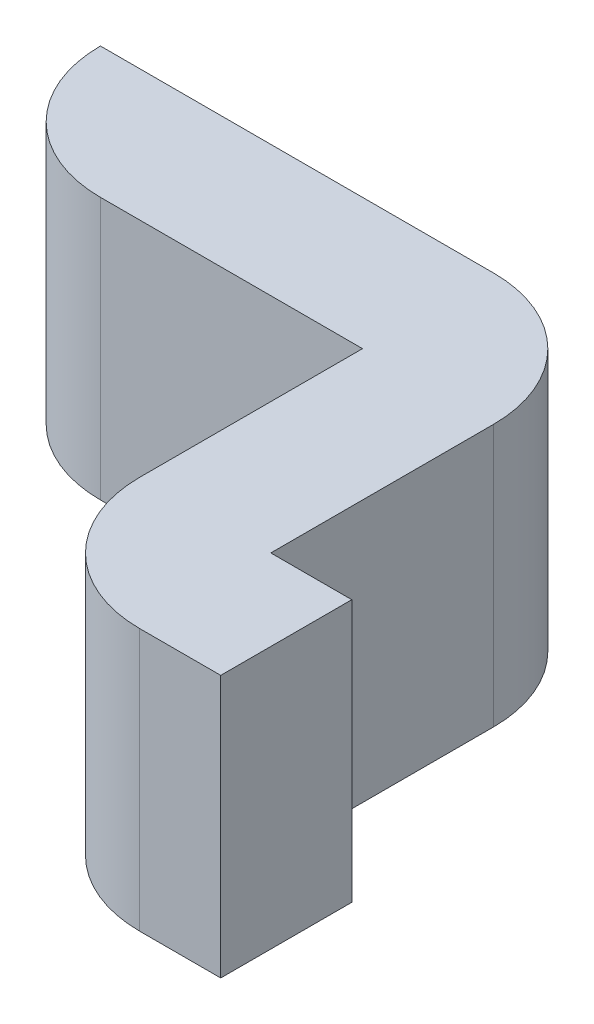
ISO-10303-21;
HEADER;
FILE_DESCRIPTION(('STEP AP214'),'2;1');
FILE_NAME('part.step','',(''),(''),'','','');
FILE_SCHEMA(('AUTOMOTIVE_DESIGN { 1 0 10303 214 1 1 1 1 }'));
ENDSEC;
DATA;
#1=APPLICATION_CONTEXT('core data for automotive mechanical design processes');
#2=APPLICATION_PROTOCOL_DEFINITION('international standard','automotive_design',2000,#1);
#3=PRODUCT_CONTEXT('',#1,'mechanical');
#4=PRODUCT('Part','Part','',(#3));
#5=PRODUCT_RELATED_PRODUCT_CATEGORY('part','',(#4));
#6=PRODUCT_DEFINITION_FORMATION('','',#4);
#7=PRODUCT_DEFINITION_CONTEXT('part definition',#1,'design');
#8=PRODUCT_DEFINITION('design','',#6,#7);
#9=PRODUCT_DEFINITION_SHAPE('','',#8);
#10=(LENGTH_UNIT() NAMED_UNIT(*) SI_UNIT(.MILLI.,.METRE.));
#11=(NAMED_UNIT(*) PLANE_ANGLE_UNIT() SI_UNIT($,.RADIAN.));
#12=(NAMED_UNIT(*) SI_UNIT($,.STERADIAN.) SOLID_ANGLE_UNIT());
#13=UNCERTAINTY_MEASURE_WITH_UNIT(LENGTH_MEASURE(1.E-05),#10,'distance_accuracy_value','');
#14=(GEOMETRIC_REPRESENTATION_CONTEXT(3) GLOBAL_UNCERTAINTY_ASSIGNED_CONTEXT((#13)) GLOBAL_UNIT_ASSIGNED_CONTEXT((#10,
#11,#12)) REPRESENTATION_CONTEXT('',''));
#15=CARTESIAN_POINT('',(0.,0.,0.));
#16=DIRECTION('',(0.,0.,1.));
#17=DIRECTION('',(1.,0.,0.));
#18=AXIS2_PLACEMENT_3D('',#15,#16,#17);
#19=CARTESIAN_POINT('',(0.8763,1.2954,0.));
#20=DIRECTION('',(0.,-1.,0.));
#21=DIRECTION('',(0.,0.,-1.));
#22=AXIS2_PLACEMENT_3D('',#19,#20,#21);
#23=PLANE('',#22);
#24=DIRECTION('',(-1.,0.,0.));
#25=VECTOR('',#24,1.);
#26=CARTESIAN_POINT('',(1.0033,1.2954,0.127));
#27=LINE('',#26,#25);
#28=CARTESIAN_POINT('',(1.0033,1.2954,0.127));
#29=VERTEX_POINT('',#28);
#30=CARTESIAN_POINT('',(1.2573,1.2954,0.127));
#31=VERTEX_POINT('',#30);
#32=EDGE_CURVE('E102',#29,#31,#27,.F.);
#33=ORIENTED_EDGE('',*,*,#32,.T.);
#34=DIRECTION('',(0.,0.,-1.));
#35=VECTOR('',#34,1.);
#36=CARTESIAN_POINT('',(1.2573,1.2954,0.127));
#37=LINE('',#36,#35);
#38=CARTESIAN_POINT('',(1.2573,1.2954,0.3429));
#39=VERTEX_POINT('',#38);
#40=EDGE_CURVE('E105',#31,#39,#37,.F.);
#41=ORIENTED_EDGE('',*,*,#40,.T.);
#42=CARTESIAN_POINT('',(1.3843,1.2954,0.3429));
#43=DIRECTION('',(0.,-1.,0.));
#44=DIRECTION('',(0.,0.,-1.));
#45=AXIS2_PLACEMENT_3D('',#42,#43,#44);
#46=CIRCLE('',#45,0.127);
#47=CARTESIAN_POINT('',(1.3843,1.2954,0.4699));
#48=VERTEX_POINT('',#47);
#49=EDGE_CURVE('E117',#48,#39,#46,.T.);
#50=ORIENTED_EDGE('',*,*,#49,.F.);
#51=DIRECTION('',(-1.,0.,0.));
#52=VECTOR('',#51,1.);
#53=CARTESIAN_POINT('',(1.3843,1.2954,0.4699));
#54=LINE('',#53,#52);
#55=CARTESIAN_POINT('',(1.462781115147,1.2954,0.4699));
#56=VERTEX_POINT('',#55);
#57=EDGE_CURVE('E134',#48,#56,#54,.F.);
#58=ORIENTED_EDGE('',*,*,#57,.T.);
#59=DIRECTION('',(0.,0.,1.));
#60=VECTOR('',#59,1.);
#61=CARTESIAN_POINT('',(1.462781115147,1.2954,0.4699));
#62=LINE('',#61,#60);
#63=CARTESIAN_POINT('',(1.462781115147,1.2954,0.3429));
#64=VERTEX_POINT('',#63);
#65=EDGE_CURVE('E90',#56,#64,#62,.F.);
#66=ORIENTED_EDGE('',*,*,#65,.T.);
#67=DIRECTION('',(1.,0.,0.));
#68=VECTOR('',#67,1.);
#69=CARTESIAN_POINT('',(1.462781115147,1.2954,0.3429));
#70=LINE('',#69,#68);
#71=CARTESIAN_POINT('',(1.3843,1.2954,0.3429));
#72=VERTEX_POINT('',#71);
#73=EDGE_CURVE('E87',#64,#72,#70,.F.);
#74=ORIENTED_EDGE('',*,*,#73,.T.);
#75=DIRECTION('',(0.,0.,1.));
#76=VECTOR('',#75,1.);
#77=CARTESIAN_POINT('',(1.3843,1.2954,0.3429));
#78=LINE('',#77,#76);
#79=CARTESIAN_POINT('',(1.3843,1.2954,0.127));
#80=VERTEX_POINT('',#79);
#81=EDGE_CURVE('E82',#72,#80,#78,.F.);
#82=ORIENTED_EDGE('',*,*,#81,.T.);
#83=CARTESIAN_POINT('',(1.2573,1.2954,0.127));
#84=DIRECTION('',(0.,-1.,0.));
#85=DIRECTION('',(0.,0.,-1.));
#86=AXIS2_PLACEMENT_3D('',#83,#84,#85);
#87=CIRCLE('',#86,0.127);
#88=CARTESIAN_POINT('',(1.2573,1.2954,0.));
#89=VERTEX_POINT('',#88);
#90=EDGE_CURVE('E20',#89,#80,#87,.T.);
#91=ORIENTED_EDGE('',*,*,#90,.F.);
#92=DIRECTION('',(1.,0.,0.));
#93=VECTOR('',#92,1.);
#94=CARTESIAN_POINT('',(1.2573,1.2954,0.));
#95=LINE('',#94,#93);
#96=CARTESIAN_POINT('',(0.8763,1.2954,0.));
#97=VERTEX_POINT('',#96);
#98=EDGE_CURVE('E76',#89,#97,#95,.F.);
#99=ORIENTED_EDGE('',*,*,#98,.T.);
#100=CARTESIAN_POINT('',(1.0033,1.2954,0.));
#101=DIRECTION('',(0.,-1.,0.));
#102=DIRECTION('',(0.,0.,-1.));
#103=AXIS2_PLACEMENT_3D('',#100,#101,#102);
#104=CIRCLE('',#103,0.127);
#105=EDGE_CURVE('E108',#29,#97,#104,.T.);
#106=ORIENTED_EDGE('',*,*,#105,.F.);
#107=EDGE_LOOP('',(#33,#41,#50,#58,#66,#74,#82,#91,#99,#106));
#108=FACE_BOUND('',#107,.T.);
#109=ADVANCED_FACE('F17',(#108),#23,.F.);
#110=CARTESIAN_POINT('',(1.2573,1.0414,0.));
#111=DIRECTION('',(0.,0.,1.));
#112=DIRECTION('',(1.,0.,0.));
#113=AXIS2_PLACEMENT_3D('',#110,#111,#112);
#114=PLANE('',#113);
#115=DIRECTION('',(0.,-1.,0.));
#116=VECTOR('',#115,1.);
#117=CARTESIAN_POINT('',(0.8763,1.0414,0.));
#118=LINE('',#117,#116);
#119=CARTESIAN_POINT('',(0.8763,1.0414,0.));
#120=VERTEX_POINT('',#119);
#121=EDGE_CURVE('E187',#97,#120,#118,.T.);
#122=ORIENTED_EDGE('',*,*,#121,.F.);
#123=ORIENTED_EDGE('',*,*,#98,.F.);
#124=DIRECTION('',(0.,-1.,0.));
#125=VECTOR('',#124,1.);
#126=CARTESIAN_POINT('',(1.2573,1.0414,0.));
#127=LINE('',#126,#125);
#128=CARTESIAN_POINT('',(1.2573,1.0414,0.));
#129=VERTEX_POINT('',#128);
#130=EDGE_CURVE('E159',#129,#89,#127,.F.);
#131=ORIENTED_EDGE('',*,*,#130,.F.);
#132=DIRECTION('',(1.,0.,0.));
#133=VECTOR('',#132,1.);
#134=CARTESIAN_POINT('',(0.8763,1.0414,0.));
#135=LINE('',#134,#133);
#136=EDGE_CURVE('E186',#120,#129,#135,.T.);
#137=ORIENTED_EDGE('',*,*,#136,.F.);
#138=EDGE_LOOP('',(#122,#123,#131,#137));
#139=FACE_BOUND('',#138,.T.);
#140=ADVANCED_FACE('F217',(#139),#114,.F.);
#141=CARTESIAN_POINT('',(1.2573,1.0414,0.127));
#142=DIRECTION('',(0.,-1.,0.));
#143=DIRECTION('',(0.,0.,-1.));
#144=AXIS2_PLACEMENT_3D('',#141,#142,#143);
#145=CYLINDRICAL_SURFACE('',#144,0.127);
#146=ORIENTED_EDGE('',*,*,#90,.T.);
#147=DIRECTION('',(0.,1.,0.));
#148=VECTOR('',#147,1.);
#149=CARTESIAN_POINT('',(1.3843,1.0414,0.127));
#150=LINE('',#149,#148);
#151=CARTESIAN_POINT('',(1.3843,1.0414,0.127));
#152=VERTEX_POINT('',#151);
#153=EDGE_CURVE('E157',#80,#152,#150,.F.);
#154=ORIENTED_EDGE('',*,*,#153,.T.);
#155=CARTESIAN_POINT('',(1.2573,1.0414,0.127));
#156=DIRECTION('',(0.,-1.,0.));
#157=DIRECTION('',(0.,0.,-1.));
#158=AXIS2_PLACEMENT_3D('',#155,#156,#157);
#159=CIRCLE('',#158,0.127);
#160=EDGE_CURVE('E183',#129,#152,#159,.T.);
#161=ORIENTED_EDGE('',*,*,#160,.F.);
#162=ORIENTED_EDGE('',*,*,#130,.T.);
#163=EDGE_LOOP('',(#146,#154,#161,#162));
#164=FACE_BOUND('',#163,.T.);
#165=ADVANCED_FACE('F214',(#164),#145,.T.);
#166=CARTESIAN_POINT('',(1.3843,1.0414,0.3429));
#167=DIRECTION('',(-1.,0.,0.));
#168=DIRECTION('',(0.,0.,1.));
#169=AXIS2_PLACEMENT_3D('',#166,#167,#168);
#170=PLANE('',#169);
#171=ORIENTED_EDGE('',*,*,#153,.F.);
#172=ORIENTED_EDGE('',*,*,#81,.F.);
#173=DIRECTION('',(0.,1.,0.));
#174=VECTOR('',#173,1.);
#175=CARTESIAN_POINT('',(1.3843,1.0414,0.3429));
#176=LINE('',#175,#174);
#177=CARTESIAN_POINT('',(1.3843,1.0414,0.3429));
#178=VERTEX_POINT('',#177);
#179=EDGE_CURVE('E153',#72,#178,#176,.F.);
#180=ORIENTED_EDGE('',*,*,#179,.T.);
#181=DIRECTION('',(0.,0.,-1.));
#182=VECTOR('',#181,1.);
#183=CARTESIAN_POINT('',(1.3843,1.0414,0.));
#184=LINE('',#183,#182);
#185=EDGE_CURVE('E150',#152,#178,#184,.F.);
#186=ORIENTED_EDGE('',*,*,#185,.F.);
#187=EDGE_LOOP('',(#171,#172,#180,#186));
#188=FACE_BOUND('',#187,.T.);
#189=ADVANCED_FACE('F211',(#188),#170,.F.);
#190=CARTESIAN_POINT('',(1.462781115147,1.0414,0.3429));
#191=DIRECTION('',(0.,0.,1.));
#192=DIRECTION('',(1.,0.,0.));
#193=AXIS2_PLACEMENT_3D('',#190,#191,#192);
#194=PLANE('',#193);
#195=ORIENTED_EDGE('',*,*,#179,.F.);
#196=ORIENTED_EDGE('',*,*,#73,.F.);
#197=DIRECTION('',(0.,1.,0.));
#198=VECTOR('',#197,1.);
#199=CARTESIAN_POINT('',(1.462781115147,1.0414,0.3429));
#200=LINE('',#199,#198);
#201=CARTESIAN_POINT('',(1.462781115147,1.0414,0.3429));
#202=VERTEX_POINT('',#201);
#203=EDGE_CURVE('E144',#64,#202,#200,.F.);
#204=ORIENTED_EDGE('',*,*,#203,.T.);
#205=DIRECTION('',(1.,0.,0.));
#206=VECTOR('',#205,1.);
#207=CARTESIAN_POINT('',(0.8763,1.0414,0.3429));
#208=LINE('',#207,#206);
#209=EDGE_CURVE('E141',#178,#202,#208,.T.);
#210=ORIENTED_EDGE('',*,*,#209,.F.);
#211=EDGE_LOOP('',(#195,#196,#204,#210));
#212=FACE_BOUND('',#211,.T.);
#213=ADVANCED_FACE('F208',(#212),#194,.F.);
#214=CARTESIAN_POINT('',(1.462781115147,1.0414,0.4699));
#215=DIRECTION('',(-1.,0.,0.));
#216=DIRECTION('',(0.,0.,1.));
#217=AXIS2_PLACEMENT_3D('',#214,#215,#216);
#218=PLANE('',#217);
#219=ORIENTED_EDGE('',*,*,#203,.F.);
#220=ORIENTED_EDGE('',*,*,#65,.F.);
#221=DIRECTION('',(0.,1.,0.));
#222=VECTOR('',#221,1.);
#223=CARTESIAN_POINT('',(1.462781115147,1.0414,0.4699));
#224=LINE('',#223,#222);
#225=CARTESIAN_POINT('',(1.462781115147,1.0414,0.4699));
#226=VERTEX_POINT('',#225);
#227=EDGE_CURVE('E132',#56,#226,#224,.F.);
#228=ORIENTED_EDGE('',*,*,#227,.T.);
#229=DIRECTION('',(0.,0.,-1.));
#230=VECTOR('',#229,1.);
#231=CARTESIAN_POINT('',(1.462781115147,1.0414,0.));
#232=LINE('',#231,#230);
#233=EDGE_CURVE('E137',#202,#226,#232,.F.);
#234=ORIENTED_EDGE('',*,*,#233,.F.);
#235=EDGE_LOOP('',(#219,#220,#228,#234));
#236=FACE_BOUND('',#235,.T.);
#237=ADVANCED_FACE('F195',(#236),#218,.F.);
#238=CARTESIAN_POINT('',(1.3843,1.0414,0.4699));
#239=DIRECTION('',(0.,0.,-1.));
#240=DIRECTION('',(-1.,0.,0.));
#241=AXIS2_PLACEMENT_3D('',#238,#239,#240);
#242=PLANE('',#241);
#243=ORIENTED_EDGE('',*,*,#227,.F.);
#244=ORIENTED_EDGE('',*,*,#57,.F.);
#245=DIRECTION('',(0.,-1.,0.));
#246=VECTOR('',#245,1.);
#247=CARTESIAN_POINT('',(1.3843,1.0414,0.4699));
#248=LINE('',#247,#246);
#249=CARTESIAN_POINT('',(1.3843,1.0414,0.4699));
#250=VERTEX_POINT('',#249);
#251=EDGE_CURVE('E129',#250,#48,#248,.F.);
#252=ORIENTED_EDGE('',*,*,#251,.F.);
#253=DIRECTION('',(1.,0.,0.));
#254=VECTOR('',#253,1.);
#255=CARTESIAN_POINT('',(0.8763,1.0414,0.4699));
#256=LINE('',#255,#254);
#257=EDGE_CURVE('E140',#226,#250,#256,.F.);
#258=ORIENTED_EDGE('',*,*,#257,.F.);
#259=EDGE_LOOP('',(#243,#244,#252,#258));
#260=FACE_BOUND('',#259,.T.);
#261=ADVANCED_FACE('F198',(#260),#242,.F.);
#262=CARTESIAN_POINT('',(1.3843,1.0414,0.3429));
#263=DIRECTION('',(0.,-1.,0.));
#264=DIRECTION('',(0.,0.,-1.));
#265=AXIS2_PLACEMENT_3D('',#262,#263,#264);
#266=CYLINDRICAL_SURFACE('',#265,0.127);
#267=ORIENTED_EDGE('',*,*,#49,.T.);
#268=DIRECTION('',(0.,1.,0.));
#269=VECTOR('',#268,1.);
#270=CARTESIAN_POINT('',(1.2573,1.0414,0.3429));
#271=LINE('',#270,#269);
#272=CARTESIAN_POINT('',(1.2573,1.0414,0.3429));
#273=VERTEX_POINT('',#272);
#274=EDGE_CURVE('E111',#39,#273,#271,.F.);
#275=ORIENTED_EDGE('',*,*,#274,.T.);
#276=CARTESIAN_POINT('',(1.3843,1.0414,0.3429));
#277=DIRECTION('',(0.,-1.,0.));
#278=DIRECTION('',(0.,0.,-1.));
#279=AXIS2_PLACEMENT_3D('',#276,#277,#278);
#280=CIRCLE('',#279,0.127);
#281=EDGE_CURVE('E179',#250,#273,#280,.T.);
#282=ORIENTED_EDGE('',*,*,#281,.F.);
#283=ORIENTED_EDGE('',*,*,#251,.T.);
#284=EDGE_LOOP('',(#267,#275,#282,#283));
#285=FACE_BOUND('',#284,.T.);
#286=ADVANCED_FACE('F189',(#285),#266,.T.);
#287=CARTESIAN_POINT('',(1.2573,1.0414,0.127));
#288=DIRECTION('',(1.,0.,0.));
#289=DIRECTION('',(0.,0.,-1.));
#290=AXIS2_PLACEMENT_3D('',#287,#288,#289);
#291=PLANE('',#290);
#292=ORIENTED_EDGE('',*,*,#274,.F.);
#293=ORIENTED_EDGE('',*,*,#40,.F.);
#294=DIRECTION('',(0.,1.,0.));
#295=VECTOR('',#294,1.);
#296=CARTESIAN_POINT('',(1.2573,1.0414,0.127));
#297=LINE('',#296,#295);
#298=CARTESIAN_POINT('',(1.2573,1.0414,0.127));
#299=VERTEX_POINT('',#298);
#300=EDGE_CURVE('E110',#31,#299,#297,.F.);
#301=ORIENTED_EDGE('',*,*,#300,.T.);
#302=DIRECTION('',(0.,0.,-1.));
#303=VECTOR('',#302,1.);
#304=CARTESIAN_POINT('',(1.2573,1.0414,0.));
#305=LINE('',#304,#303);
#306=EDGE_CURVE('E182',#273,#299,#305,.T.);
#307=ORIENTED_EDGE('',*,*,#306,.F.);
#308=EDGE_LOOP('',(#292,#293,#301,#307));
#309=FACE_BOUND('',#308,.T.);
#310=ADVANCED_FACE('F115',(#309),#291,.F.);
#311=CARTESIAN_POINT('',(1.0033,1.0414,0.127));
#312=DIRECTION('',(0.,0.,-1.));
#313=DIRECTION('',(-1.,0.,0.));
#314=AXIS2_PLACEMENT_3D('',#311,#312,#313);
#315=PLANE('',#314);
#316=ORIENTED_EDGE('',*,*,#300,.F.);
#317=ORIENTED_EDGE('',*,*,#32,.F.);
#318=DIRECTION('',(0.,-1.,0.));
#319=VECTOR('',#318,1.);
#320=CARTESIAN_POINT('',(1.0033,1.0414,0.127));
#321=LINE('',#320,#319);
#322=CARTESIAN_POINT('',(1.0033,1.0414,0.127));
#323=VERTEX_POINT('',#322);
#324=EDGE_CURVE('E35',#323,#29,#321,.F.);
#325=ORIENTED_EDGE('',*,*,#324,.F.);
#326=DIRECTION('',(1.,0.,0.));
#327=VECTOR('',#326,1.);
#328=CARTESIAN_POINT('',(0.8763,1.0414,0.127));
#329=LINE('',#328,#327);
#330=EDGE_CURVE('E26',#299,#323,#329,.F.);
#331=ORIENTED_EDGE('',*,*,#330,.F.);
#332=EDGE_LOOP('',(#316,#317,#325,#331));
#333=FACE_BOUND('',#332,.T.);
#334=ADVANCED_FACE('F119',(#333),#315,.F.);
#335=CARTESIAN_POINT('',(1.0033,1.0414,0.));
#336=DIRECTION('',(0.,-1.,0.));
#337=DIRECTION('',(0.,0.,-1.));
#338=AXIS2_PLACEMENT_3D('',#335,#336,#337);
#339=CYLINDRICAL_SURFACE('',#338,0.127);
#340=ORIENTED_EDGE('',*,*,#105,.T.);
#341=ORIENTED_EDGE('',*,*,#121,.T.);
#342=CARTESIAN_POINT('',(1.0033,1.0414,0.));
#343=DIRECTION('',(0.,-1.,0.));
#344=DIRECTION('',(0.,0.,-1.));
#345=AXIS2_PLACEMENT_3D('',#342,#343,#344);
#346=CIRCLE('',#345,0.127);
#347=EDGE_CURVE('E11',#323,#120,#346,.T.);
#348=ORIENTED_EDGE('',*,*,#347,.F.);
#349=ORIENTED_EDGE('',*,*,#324,.T.);
#350=EDGE_LOOP('',(#340,#341,#348,#349));
#351=FACE_BOUND('',#350,.T.);
#352=ADVANCED_FACE('F219',(#351),#339,.T.);
#353=CARTESIAN_POINT('',(0.8763,1.0414,0.));
#354=DIRECTION('',(0.,-1.,0.));
#355=DIRECTION('',(0.,0.,-1.));
#356=AXIS2_PLACEMENT_3D('',#353,#354,#355);
#357=PLANE('',#356);
#358=ORIENTED_EDGE('',*,*,#330,.T.);
#359=ORIENTED_EDGE('',*,*,#347,.T.);
#360=ORIENTED_EDGE('',*,*,#136,.T.);
#361=ORIENTED_EDGE('',*,*,#160,.T.);
#362=ORIENTED_EDGE('',*,*,#185,.T.);
#363=ORIENTED_EDGE('',*,*,#209,.T.);
#364=ORIENTED_EDGE('',*,*,#233,.T.);
#365=ORIENTED_EDGE('',*,*,#257,.T.);
#366=ORIENTED_EDGE('',*,*,#281,.T.);
#367=ORIENTED_EDGE('',*,*,#306,.T.);
#368=EDGE_LOOP('',(#358,#359,#360,#361,#362,#363,#364,#365,#366,#367));
#369=FACE_BOUND('',#368,.T.);
#370=ADVANCED_FACE('F202',(#369),#357,.T.);
#371=CLOSED_SHELL('',(#109,#140,#165,#189,#213,#237,#261,#286,#310,#334,#352,#370));
#372=MANIFOLD_SOLID_BREP('B1',#371);
#373=ADVANCED_BREP_SHAPE_REPRESENTATION('',(#18,#372),#14);
#374=SHAPE_DEFINITION_REPRESENTATION(#9,#373);
ENDSEC;
END-ISO-10303-21;
